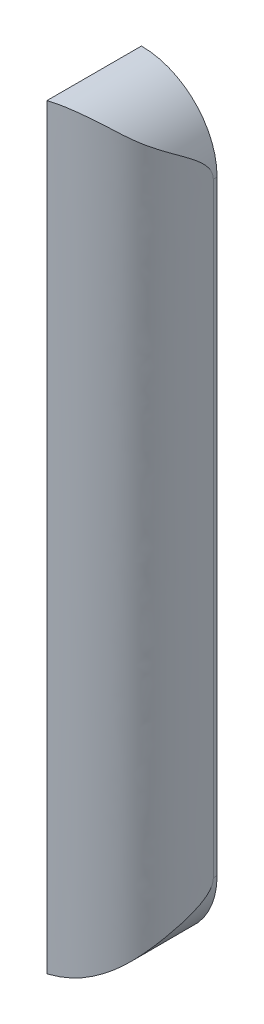
ISO-10303-21;
HEADER;
FILE_DESCRIPTION(('STEP AP214'),'2;1');
FILE_NAME('part.step','',(''),(''),'','','');
FILE_SCHEMA(('AUTOMOTIVE_DESIGN { 1 0 10303 214 1 1 1 1 }'));
ENDSEC;
DATA;
#1=APPLICATION_CONTEXT('core data for automotive mechanical design processes');
#2=APPLICATION_PROTOCOL_DEFINITION('international standard','automotive_design',2000,#1);
#3=PRODUCT_CONTEXT('',#1,'mechanical');
#4=PRODUCT('Part','Part','',(#3));
#5=PRODUCT_RELATED_PRODUCT_CATEGORY('part','',(#4));
#6=PRODUCT_DEFINITION_FORMATION('','',#4);
#7=PRODUCT_DEFINITION_CONTEXT('part definition',#1,'design');
#8=PRODUCT_DEFINITION('design','',#6,#7);
#9=PRODUCT_DEFINITION_SHAPE('','',#8);
#10=(LENGTH_UNIT() NAMED_UNIT(*) SI_UNIT(.MILLI.,.METRE.));
#11=(NAMED_UNIT(*) PLANE_ANGLE_UNIT() SI_UNIT($,.RADIAN.));
#12=(NAMED_UNIT(*) SI_UNIT($,.STERADIAN.) SOLID_ANGLE_UNIT());
#13=UNCERTAINTY_MEASURE_WITH_UNIT(LENGTH_MEASURE(1.E-05),#10,'distance_accuracy_value','');
#14=(GEOMETRIC_REPRESENTATION_CONTEXT(3) GLOBAL_UNCERTAINTY_ASSIGNED_CONTEXT((#13)) GLOBAL_UNIT_ASSIGNED_CONTEXT((#10,
#11,#12)) REPRESENTATION_CONTEXT('',''));
#15=CARTESIAN_POINT('',(0.,0.,0.));
#16=DIRECTION('',(0.,0.,1.));
#17=DIRECTION('',(1.,0.,0.));
#18=AXIS2_PLACEMENT_3D('',#15,#16,#17);
#19=CARTESIAN_POINT('',(-4.00000000000001,40.,0.4));
#20=DIRECTION('',(1.,0.,0.));
#21=DIRECTION('',(0.,1.,0.));
#22=AXIS2_PLACEMENT_3D('',#19,#20,#21);
#23=PLANE('',#22);
#24=DIRECTION('',(0.,-1.,0.));
#25=VECTOR('',#24,1.);
#26=CARTESIAN_POINT('',(-4.00000000000001,40.,0.));
#27=LINE('',#26,#25);
#28=CARTESIAN_POINT('',(-4.00000000000001,40.,0.));
#29=VERTEX_POINT('',#28);
#30=CARTESIAN_POINT('',(-4.,-40.,0.));
#31=VERTEX_POINT('',#30);
#32=EDGE_CURVE('E127',#29,#31,#27,.T.);
#33=ORIENTED_EDGE('',*,*,#32,.T.);
#34=DIRECTION('',(0.,0.,-1.));
#35=VECTOR('',#34,1.);
#36=CARTESIAN_POINT('',(-4.,-40.,0.4));
#37=LINE('',#36,#35);
#38=CARTESIAN_POINT('',(-4.,-40.,10.));
#39=VERTEX_POINT('',#38);
#40=EDGE_CURVE('E137',#39,#31,#37,.T.);
#41=ORIENTED_EDGE('',*,*,#40,.F.);
#42=DIRECTION('',(0.,-1.,0.));
#43=VECTOR('',#42,1.);
#44=CARTESIAN_POINT('',(-4.,52.8062484748657,10.));
#45=LINE('',#44,#43);
#46=CARTESIAN_POINT('',(-4.,40.,10.));
#47=VERTEX_POINT('',#46);
#48=EDGE_CURVE('E123',#47,#39,#45,.T.);
#49=ORIENTED_EDGE('',*,*,#48,.F.);
#50=DIRECTION('',(0.,0.,-1.));
#51=VECTOR('',#50,1.);
#52=CARTESIAN_POINT('',(-4.00000000000001,40.,0.4));
#53=LINE('',#52,#51);
#54=EDGE_CURVE('E130',#47,#29,#53,.T.);
#55=ORIENTED_EDGE('',*,*,#54,.T.);
#56=EDGE_LOOP('',(#33,#41,#49,#55));
#57=FACE_BOUND('',#56,.T.);
#58=DIRECTION('',(0.,-1.,0.));
#59=VECTOR('',#58,1.);
#60=CARTESIAN_POINT('',(-4.00000000000001,40.,1.));
#61=LINE('',#60,#59);
#62=CARTESIAN_POINT('',(-4.00000000000001,39.,1.));
#63=VERTEX_POINT('',#62);
#64=CARTESIAN_POINT('',(-4.,-39.,1.));
#65=VERTEX_POINT('',#64);
#66=EDGE_CURVE('E108',#63,#65,#61,.T.);
#67=ORIENTED_EDGE('',*,*,#66,.F.);
#68=DIRECTION('',(0.,0.,-1.));
#69=VECTOR('',#68,1.);
#70=CARTESIAN_POINT('',(-4.00000000000001,39.,8.94346104894894));
#71=LINE('',#70,#69);
#72=CARTESIAN_POINT('',(-4.00000000000001,39.,8.94346104894894));
#73=VERTEX_POINT('',#72);
#74=EDGE_CURVE('E114',#73,#63,#71,.T.);
#75=ORIENTED_EDGE('',*,*,#74,.F.);
#76=DIRECTION('',(0.,-1.,0.));
#77=VECTOR('',#76,1.);
#78=CARTESIAN_POINT('',(-4.00000000000001,39.,8.94346104894894));
#79=LINE('',#78,#77);
#80=CARTESIAN_POINT('',(-4.,-39.,8.94346104894894));
#81=VERTEX_POINT('',#80);
#82=EDGE_CURVE('E51',#73,#81,#79,.T.);
#83=ORIENTED_EDGE('',*,*,#82,.T.);
#84=DIRECTION('',(0.,0.,-1.));
#85=VECTOR('',#84,1.);
#86=CARTESIAN_POINT('',(-4.,-39.,8.94346104894894));
#87=LINE('',#86,#85);
#88=EDGE_CURVE('E102',#81,#65,#87,.T.);
#89=ORIENTED_EDGE('',*,*,#88,.T.);
#90=EDGE_LOOP('',(#67,#75,#83,#89));
#91=FACE_BOUND('',#90,.T.);
#92=ADVANCED_FACE('F31',(#57,#91),#23,.F.);
#93=CARTESIAN_POINT('',(3.99999999999998,40.,0.4));
#94=DIRECTION('',(-1.,0.,0.));
#95=DIRECTION('',(0.,-1.,0.));
#96=AXIS2_PLACEMENT_3D('',#93,#94,#95);
#97=PLANE('',#96);
#98=DIRECTION('',(0.,1.,0.));
#99=VECTOR('',#98,1.);
#100=CARTESIAN_POINT('',(3.99999999999998,40.,0.));
#101=LINE('',#100,#99);
#102=CARTESIAN_POINT('',(4.,-32.,0.));
#103=VERTEX_POINT('',#102);
#104=CARTESIAN_POINT('',(3.99999999999999,32.,0.));
#105=VERTEX_POINT('',#104);
#106=EDGE_CURVE('E131',#103,#105,#101,.T.);
#107=ORIENTED_EDGE('',*,*,#106,.T.);
#108=DIRECTION('',(0.,0.,-1.));
#109=VECTOR('',#108,1.);
#110=CARTESIAN_POINT('',(3.99999999999999,32.,0.4));
#111=LINE('',#110,#109);
#112=CARTESIAN_POINT('',(3.99999999999999,32.,0.4));
#113=VERTEX_POINT('',#112);
#114=EDGE_CURVE('E59',#105,#113,#111,.F.);
#115=ORIENTED_EDGE('',*,*,#114,.T.);
#116=DIRECTION('',(0.,1.,0.));
#117=VECTOR('',#116,1.);
#118=CARTESIAN_POINT('',(3.99999999999998,40.,0.4));
#119=LINE('',#118,#117);
#120=CARTESIAN_POINT('',(4.,-32.,0.4));
#121=VERTEX_POINT('',#120);
#122=EDGE_CURVE('E128',#121,#113,#119,.T.);
#123=ORIENTED_EDGE('',*,*,#122,.F.);
#124=DIRECTION('',(0.,0.,-1.));
#125=VECTOR('',#124,1.);
#126=CARTESIAN_POINT('',(4.,-32.,0.4));
#127=LINE('',#126,#125);
#128=EDGE_CURVE('E144',#121,#103,#127,.T.);
#129=ORIENTED_EDGE('',*,*,#128,.T.);
#130=EDGE_LOOP('',(#107,#115,#123,#129));
#131=FACE_BOUND('',#130,.T.);
#132=ADVANCED_FACE('F189',(#131),#97,.F.);
#133=CARTESIAN_POINT('',(-4.,-40.,0.));
#134=DIRECTION('',(0.,0.,1.));
#135=DIRECTION('',(1.,0.,0.));
#136=AXIS2_PLACEMENT_3D('',#133,#134,#135);
#137=PLANE('',#136);
#138=ORIENTED_EDGE('',*,*,#32,.F.);
#139=CARTESIAN_POINT('',(-4.00000000000001,32.,0.));
#140=DIRECTION('',(0.,0.,1.));
#141=DIRECTION('',(1.,0.,0.));
#142=AXIS2_PLACEMENT_3D('',#139,#140,#141);
#143=CIRCLE('',#142,8.);
#144=EDGE_CURVE('E142',#29,#105,#143,.F.);
#145=ORIENTED_EDGE('',*,*,#144,.T.);
#146=ORIENTED_EDGE('',*,*,#106,.F.);
#147=CARTESIAN_POINT('',(-4.,-32.,0.));
#148=DIRECTION('',(0.,0.,1.));
#149=DIRECTION('',(1.,0.,0.));
#150=AXIS2_PLACEMENT_3D('',#147,#148,#149);
#151=CIRCLE('',#150,8.);
#152=EDGE_CURVE('E140',#103,#31,#151,.F.);
#153=ORIENTED_EDGE('',*,*,#152,.T.);
#154=EDGE_LOOP('',(#138,#145,#146,#153));
#155=FACE_BOUND('',#154,.T.);
#156=ADVANCED_FACE('F156',(#155),#137,.F.);
#157=CARTESIAN_POINT('',(4.00000000000001,52.8062484748657,0.399999999999993));
#158=CARTESIAN_POINT('',(3.45990071294035,52.8062484748657,2.8916558516028));
#159=CARTESIAN_POINT('',(2.80557940591991,52.8062484748657,5.91025549157195));
#160=CARTESIAN_POINT('',(-0.739115300552893,52.8062484748657,8.89056329612947));
#161=CARTESIAN_POINT('',(-2.54040997583752,52.8062484748657,9.5034099961634));
#162=CARTESIAN_POINT('',(-4.,52.8062484748657,10.));
#163=B_SPLINE_CURVE_WITH_KNOTS('',3,(#157,#158,#159,#160,#161,#162),.UNSPECIFIED.,.F.,.F.,(4,1,
1,4),(0.,0.472850407692934,0.572850407692934,1.),.UNSPECIFIED.);
#164=DIRECTION('',(0.,-1.,0.));
#165=VECTOR('',#164,1.);
#166=SURFACE_OF_LINEAR_EXTRUSION('',#163,#165);
#167=ORIENTED_EDGE('',*,*,#122,.T.);
#168=CARTESIAN_POINT('',(3.99999999999999,32.,0.4));
#169=CARTESIAN_POINT('',(4.0000056620052,32.0525621529477,0.399973787301287));
#170=CARTESIAN_POINT('',(3.99948219702425,32.1051096960676,0.402388770322981));
#171=CARTESIAN_POINT('',(3.99742065157941,32.2096907531144,0.411899399725262));
#172=CARTESIAN_POINT('',(3.99588393285891,32.2617248619337,0.418988764058434));
#173=CARTESIAN_POINT('',(3.99186724188595,32.3642245573067,0.437518536287896));
#174=CARTESIAN_POINT('',(3.98940059314111,32.4147018819559,0.448897485307127));
#175=CARTESIAN_POINT('',(3.98359289393308,32.5145338588227,0.475686410071853));
#176=CARTESIAN_POINT('',(3.98025151057988,32.5638880758402,0.491097920452378));
#177=CARTESIAN_POINT('',(3.97159699575429,32.676581837533,0.531006621363169));
#178=CARTESIAN_POINT('',(3.96599432499394,32.7394279739851,0.556836535063332));
#179=CARTESIAN_POINT('',(3.95361019354151,32.8625058508912,0.613895069680141));
#180=CARTESIAN_POINT('',(3.94682808672251,32.9227361355899,0.645126649724052));
#181=CARTESIAN_POINT('',(3.93223247294435,33.0407902438395,0.712265519307851));
#182=CARTESIAN_POINT('',(3.92441391411204,33.0986003277967,0.74819569834093));
#183=CARTESIAN_POINT('',(3.90793227927584,33.2115542152776,0.823807699069402));
#184=CARTESIAN_POINT('',(3.89926928922898,33.2666982893288,0.863489138901021));
#185=CARTESIAN_POINT('',(3.87581727360709,33.406824907157,0.970655458170629));
#186=CARTESIAN_POINT('',(3.8604695577568,33.4898735225795,1.04054518311864));
#187=CARTESIAN_POINT('',(3.82830654665539,33.6505570778675,1.18613125283798));
#188=CARTESIAN_POINT('',(3.81148899380341,33.7281833482045,1.26183650761004));
#189=CARTESIAN_POINT('',(3.77662275067671,33.8788614589722,1.41748475129463));
#190=CARTESIAN_POINT('',(3.75857312133244,33.9519097269199,1.49743096201793));
#191=CARTESIAN_POINT('',(3.72123780211654,34.0947498932021,1.6610186135431));
#192=CARTESIAN_POINT('',(3.70194352418905,34.164511740355,1.74468412835655));
#193=CARTESIAN_POINT('',(3.6623229638204,34.3008343037721,1.91419048434751));
#194=CARTESIAN_POINT('',(3.64199772644475,34.3673981335757,2.00002908017132));
#195=CARTESIAN_POINT('',(3.60030526291042,34.4980103366622,2.17330705623468));
#196=CARTESIAN_POINT('',(3.57893829897453,34.562059335723,2.26074603020197));
#197=CARTESIAN_POINT('',(3.5304552789583,34.7016303956711,2.4555058263359));
#198=CARTESIAN_POINT('',(3.50308419494607,34.7766897624624,2.56309378539224));
#199=CARTESIAN_POINT('',(3.4466321513467,34.9247119220356,2.7792636604964));
#200=CARTESIAN_POINT('',(3.41755106730908,34.9976745616451,2.88784564840095));
#201=CARTESIAN_POINT('',(3.35750192617088,35.1421795932973,3.10552816197305));
#202=CARTESIAN_POINT('',(3.32653276750393,35.2137211233164,3.21462895543805));
#203=CARTESIAN_POINT('',(3.2625277479941,35.3558536936406,3.43284407817841));
#204=CARTESIAN_POINT('',(3.22949183897251,35.4264447117413,3.54195840771009));
#205=CARTESIAN_POINT('',(3.12689862635997,35.637567447715,3.86893142950053));
#206=CARTESIAN_POINT('',(3.05390686371897,35.7773258574395,4.08623114127537));
#207=CARTESIAN_POINT('',(2.89759603481086,36.0556538270346,4.51431120820724));
#208=CARTESIAN_POINT('',(2.81439536657734,36.1942201763265,4.72513636902651));
#209=CARTESIAN_POINT('',(2.63490419815972,36.4727482227274,5.14001777518146));
#210=CARTESIAN_POINT('',(2.53862300740431,36.6127088624572,5.34407870729008));
#211=CARTESIAN_POINT('',(2.33061033194471,36.8942797931428,5.74278791726366));
#212=CARTESIAN_POINT('',(2.21889313422523,37.0358884490281,5.93744467697696));
#213=CARTESIAN_POINT('',(2.02036553475504,37.2696904294443,6.24765076418465));
#214=CARTESIAN_POINT('',(1.93878155158731,37.3615901391147,6.36676337041595));
#215=CARTESIAN_POINT('',(1.81035831813848,37.4994253338024,6.54097111187516));
#216=CARTESIAN_POINT('',(1.7665416225133,37.5453690576789,6.59829809515275));
#217=CARTESIAN_POINT('',(1.67681969009083,37.6371835074314,6.71135617205671));
#218=CARTESIAN_POINT('',(1.63091448328755,37.6830542343459,6.7670872885833));
#219=CARTESIAN_POINT('',(1.53696427832172,37.7746280777868,6.87681978058271));
#220=CARTESIAN_POINT('',(1.48891992265208,37.8203312402366,6.93082166716299));
#221=CARTESIAN_POINT('',(1.39062511721416,37.911484465126,7.03700069640738));
#222=CARTESIAN_POINT('',(1.34037465172189,37.956934525759,7.08917782606081));
#223=CARTESIAN_POINT('',(1.23763429831004,38.047469945897,7.1920911863011));
#224=CARTESIAN_POINT('',(1.1851374589733,38.0925535689133,7.24282199180949));
#225=CARTESIAN_POINT('',(1.07818168705945,38.1819843087341,7.34284355187832));
#226=CARTESIAN_POINT('',(1.02372273507359,38.2263314182468,7.39213429218524));
#227=CARTESIAN_POINT('',(0.912925326492705,38.3141241277927,7.48946707828617));
#228=CARTESIAN_POINT('',(0.856585898341203,38.3575692424004,7.5375084550534));
#229=CARTESIAN_POINT('',(0.742161534128726,38.4433700875375,7.63247064279101));
#230=CARTESIAN_POINT('',(0.684076602672512,38.4857258209402,7.67939145671693));
#231=CARTESIAN_POINT('',(0.566244738354594,38.5692178820285,7.77227187344215));
#232=CARTESIAN_POINT('',(0.50649726339045,38.6103538027226,7.81823115395199));
#233=CARTESIAN_POINT('',(0.385474525932925,38.6912565397663,7.90933594158969));
#234=CARTESIAN_POINT('',(0.324199258871244,38.7310233520212,7.95448144628356));
#235=CARTESIAN_POINT('',(0.200245152746142,38.8090596423984,8.04382092691052));
#236=CARTESIAN_POINT('',(0.137569215210138,38.8473318330275,8.08801655422008));
#237=CARTESIAN_POINT('',(0.0107025831820572,38.9224055174176,8.17546727469224));
#238=CARTESIAN_POINT('',(-0.0534881011174989,38.95920702107,8.21872237417975));
#239=CARTESIAN_POINT('',(-0.248272721688522,39.0672899580901,8.34694606742797));
#240=CARTESIAN_POINT('',(-0.381140753694859,39.1362886601778,8.43041753048952));
#241=CARTESIAN_POINT('',(-0.652735978756054,39.2676388119349,8.59289707564818));
#242=CARTESIAN_POINT('',(-0.7914625352011,39.3299909812606,8.67190564053115));
#243=CARTESIAN_POINT('',(-1.07428947057202,39.4473904377342,8.82510519491522));
#244=CARTESIAN_POINT('',(-1.21838238231434,39.5024474227855,8.89930251185699));
#245=CARTESIAN_POINT('',(-1.51163979651008,39.6047473454215,9.04295812396082));
#246=CARTESIAN_POINT('',(-1.66080492306986,39.6519893171898,9.1124158327573));
#247=CARTESIAN_POINT('',(-1.96348942728516,39.7380464227688,9.24679412940434));
#248=CARTESIAN_POINT('',(-2.11700729892305,39.776864431934,9.31171626023865));
#249=CARTESIAN_POINT('',(-2.36567735489167,39.8318671899365,9.41248542626524));
#250=CARTESIAN_POINT('',(-2.45969645966528,39.8509052408895,9.44960456380516));
#251=CARTESIAN_POINT('',(-2.64881302610006,39.8856535509151,9.52257294718602));
#252=CARTESIAN_POINT('',(-2.74391022794673,39.9013645945397,9.55842249074971));
#253=CARTESIAN_POINT('',(-2.93498649678357,39.9293801632255,9.62905933678257));
#254=CARTESIAN_POINT('',(-3.03096549426747,39.9416849544392,9.66384672205602));
#255=CARTESIAN_POINT('',(-3.22356423071647,39.9628217502549,9.7325864299888));
#256=CARTESIAN_POINT('',(-3.32018373521305,39.9716549612453,9.76653903888465));
#257=CARTESIAN_POINT('',(-3.51388302756396,39.9858072331562,9.8338836747545));
#258=CARTESIAN_POINT('',(-3.61096285363776,39.9911259969458,9.86727565409722));
#259=CARTESIAN_POINT('',(-3.80536158231429,39.9982242975407,9.93377935569415));
#260=CARTESIAN_POINT('',(-3.90268051388529,40.0000033819482,9.9668910415863));
#261=CARTESIAN_POINT('',(-4.,40.,10.));
#262=B_SPLINE_CURVE_WITH_KNOTS('',3,(#168,#169,#170,#171,#172,#173,#174,#175,#176,#177,#178,
#179,#180,#181,#182,#183,#184,#185,#186,#187,#188,#189,#190,#191,#192,#193,#194,#195,#196,#197,
#198,#199,#200,#201,#202,#203,#204,#205,#206,#207,#208,#209,#210,#211,#212,#213,#214,#215,#216,
#217,#218,#219,#220,#221,#222,#223,#224,#225,#226,#227,#228,#229,#230,#231,#232,#233,#234,#235,
#236,#237,#238,#239,#240,#241,#242,#243,#244,#245,#246,#247,#248,#249,#250,#251,#252,#253,#254,
#255,#256,#257,#258,#259,#260,#261),.UNSPECIFIED.,.F.,.F.,(4,2,2,2,2,2,2,2,2,2,2,2,2,2,2,2,2,2,
2,2,2,2,2,2,2,2,2,2,2,2,2,2,2,2,2,2,2,2,2,2,2,2,2,2,2,2,4),(0.,0.157605082158624,
0.31499878446165,0.470218225168206,0.625496822449932,0.829702825587646,1.03402105273842,
1.23937453822486,1.44470714198819,1.7731552991601,2.10211711423555,2.43133252055866,
2.76313131548872,3.09460024364779,3.42598616114688,3.82797021294302,4.2299835566569,
4.63223373571751,5.0344932952593,5.83970568443843,6.63633352609044,7.43239734786193,
8.2277292380783,8.74087665210632,8.99746213338689,9.25404393089612,9.51054917722622,
9.76705625208867,10.024424417309,10.2817951290536,10.5393009359609,10.7968060636092,
11.0543961627831,11.3119870322777,11.5690863489174,11.8261839360644,12.3401236167216,
12.8540075936947,13.3672014311084,13.8804586441544,14.393540390402,14.7020562940941,
15.010499364462,15.318918327356,15.6272300184108,15.935567772511,16.2439449319839),.UNSPECIFIED.);
#263=EDGE_CURVE('E11',#113,#47,#262,.T.);
#264=ORIENTED_EDGE('',*,*,#263,.T.);
#265=ORIENTED_EDGE('',*,*,#48,.T.);
#266=CARTESIAN_POINT('',(-4.,-40.,10.));
#267=CARTESIAN_POINT('',(-3.84447283803048,-40.0000219178991,9.94710256173775));
#268=CARTESIAN_POINT('',(-3.68895134287131,-39.9954655236904,9.89417682741361));
#269=CARTESIAN_POINT('',(-3.37876676374908,-39.977350458397,9.78715566847858));
#270=CARTESIAN_POINT('',(-3.22410405925413,-39.9637880845859,9.73305977161967));
#271=CARTESIAN_POINT('',(-2.91659539971233,-39.927813518292,9.62262037850314));
#272=CARTESIAN_POINT('',(-2.7637496619587,-39.9054002780763,9.56627661686168));
#273=CARTESIAN_POINT('',(-2.46102692676095,-39.8520784260535,9.45055235790945));
#274=CARTESIAN_POINT('',(-2.31114516607753,-39.821184876852,9.39117739537663));
#275=CARTESIAN_POINT('',(-2.01490379243098,-39.751293530405,9.26864395175344));
#276=CARTESIAN_POINT('',(-1.86854326362038,-39.7122978664538,9.20548646971328));
#277=CARTESIAN_POINT('',(-1.58002471948061,-39.6266873214848,9.07497553989007));
#278=CARTESIAN_POINT('',(-1.437865737371,-39.5800742096238,9.00762306863837));
#279=CARTESIAN_POINT('',(-1.15820229364525,-39.4797239059717,8.86851439302963));
#280=CARTESIAN_POINT('',(-1.02070015814107,-39.4259832179417,8.79675603682299));
#281=CARTESIAN_POINT('',(-0.750804229341034,-39.3119217352079,8.64891589520311));
#282=CARTESIAN_POINT('',(-0.618411713726137,-39.2515993089614,8.57283304004205));
#283=CARTESIAN_POINT('',(-0.359004529418871,-39.1248855666682,8.4165898154469));
#284=CARTESIAN_POINT('',(-0.231990910300238,-39.0584930740922,8.33642865687765));
#285=CARTESIAN_POINT('',(-0.0457229127340713,-38.9547635540324,8.21349675838084));
#286=CARTESIAN_POINT('',(0.0156213587121012,-38.9195197993948,8.17209731264923));
#287=CARTESIAN_POINT('',(0.13692455795081,-38.8476874365415,8.08843961079789));
#288=CARTESIAN_POINT('',(0.196883478245402,-38.8110988210498,8.04618135003231));
#289=CARTESIAN_POINT('',(0.315407360140804,-38.7366280983492,7.96087486459728));
#290=CARTESIAN_POINT('',(0.373972456510301,-38.6987461170651,7.91782671702055));
#291=CARTESIAN_POINT('',(0.489715648500922,-38.6217280930166,7.8309940396917));
#292=CARTESIAN_POINT('',(0.546893748135789,-38.5825920538819,7.78720951207116));
#293=CARTESIAN_POINT('',(0.659766889027392,-38.5031788409546,7.69876709009784));
#294=CARTESIAN_POINT('',(0.715461889248318,-38.4629016356507,7.65410917163843));
#295=CARTESIAN_POINT('',(0.825276439190265,-38.3813310058561,7.56379409291597));
#296=CARTESIAN_POINT('',(0.879395980816358,-38.340037576146,7.51813692752076));
#297=CARTESIAN_POINT('',(0.988860402726437,-38.2543075588489,7.42318146705591));
#298=CARTESIAN_POINT('',(1.04411231835133,-38.2098220307676,7.37382005841947));
#299=CARTESIAN_POINT('',(1.15264919440644,-38.1200625856558,7.273670565821));
#300=CARTESIAN_POINT('',(1.20593415388196,-38.0747886682428,7.22288248116655));
#301=CARTESIAN_POINT('',(1.31040849344844,-37.9836746387234,7.11971652250992));
#302=CARTESIAN_POINT('',(1.36159839543506,-37.9378346713741,7.06733905016856));
#303=CARTESIAN_POINT('',(1.46174119605562,-37.8458540593826,6.96074293657438));
#304=CARTESIAN_POINT('',(1.51069413489299,-37.7997134201611,6.9065243284416));
#305=CARTESIAN_POINT('',(1.60637381156809,-37.7072757722334,6.79632019332086));
#306=CARTESIAN_POINT('',(1.65310109015826,-37.6609788044668,6.74033510107496));
#307=CARTESIAN_POINT('',(1.74441635151245,-37.568295266875,6.62672067541774));
#308=CARTESIAN_POINT('',(1.78900427743246,-37.521908694703,6.5690912983815));
#309=CARTESIAN_POINT('',(1.91970181845593,-37.3826895947707,6.39385260776602));
#310=CARTESIAN_POINT('',(2.00270980987949,-37.2898320868301,6.27393378677894));
#311=CARTESIAN_POINT('',(2.1611022688758,-37.1044776892947,6.02880594537108));
#312=CARTESIAN_POINT('',(2.23648250144576,-37.011981027147,5.90359404028062));
#313=CARTESIAN_POINT('',(2.38024708683379,-36.8276396208003,5.64875789894763));
#314=CARTESIAN_POINT('',(2.44863099860537,-36.73579491804,5.51913338522087));
#315=CARTESIAN_POINT('',(2.60711748832888,-36.5135178712815,5.19973527227677));
#316=CARTESIAN_POINT('',(2.6939196873873,-36.3834697212362,5.00805852489252));
#317=CARTESIAN_POINT('',(2.85651046003813,-36.124517280451,4.61935841494876));
#318=CARTESIAN_POINT('',(2.93229731164122,-35.9956131715058,4.42233422214331));
#319=CARTESIAN_POINT('',(3.07467011256418,-35.7377472621262,4.02480843590973));
#320=CARTESIAN_POINT('',(3.14124838161882,-35.6087855024643,3.82430409490561));
#321=CARTESIAN_POINT('',(3.26663910684308,-35.3491436472443,3.42229837251792));
#322=CARTESIAN_POINT('',(3.32545933282352,-35.2184654172702,3.22079820162447));
#323=CARTESIAN_POINT('',(3.40886958179003,-35.0189084011934,2.91968651963455));
#324=CARTESIAN_POINT('',(3.43586005888077,-34.9518263104085,2.8195445674623));
#325=CARTESIAN_POINT('',(3.48836889934296,-34.8159626943129,2.62003286398485));
#326=CARTESIAN_POINT('',(3.51388733522564,-34.7471812529494,2.5206630748527));
#327=CARTESIAN_POINT('',(3.56352937475429,-34.6073967286886,2.32328941825567));
#328=CARTESIAN_POINT('',(3.58765429851539,-34.5363958499919,2.22528432707481));
#329=CARTESIAN_POINT('',(3.63459197695603,-34.3914047072401,2.03119812094587));
#330=CARTESIAN_POINT('',(3.65740494050414,-34.3174149222401,1.93511670133923));
#331=CARTESIAN_POINT('',(3.69557802652875,-34.1866276104151,1.77198910799164));
#332=CARTESIAN_POINT('',(3.71125075630309,-34.1307514763812,1.70427899789816));
#333=CARTESIAN_POINT('',(3.7418892164309,-34.0165928526653,1.57072918077983));
#334=CARTESIAN_POINT('',(3.75685486196492,-33.9583100758542,1.50488969852493));
#335=CARTESIAN_POINT('',(3.78607527793413,-33.8387048989306,1.37540119266126));
#336=CARTESIAN_POINT('',(3.80032730050014,-33.7773723282808,1.31176089094183));
#337=CARTESIAN_POINT('',(3.82796721082919,-33.6513899363172,1.18763483985136));
#338=CARTESIAN_POINT('',(3.84135511677933,-33.5867401848718,1.12714902409282));
#339=CARTESIAN_POINT('',(3.86737340535711,-33.4523139534523,1.0091065969249));
#340=CARTESIAN_POINT('',(3.87998363172415,-33.3824614919717,0.951631319147756));
#341=CARTESIAN_POINT('',(3.90392488764391,-33.2382696753337,0.842198287921142));
#342=CARTESIAN_POINT('',(3.91525552236129,-33.1639289460604,0.790242237796065));
#343=CARTESIAN_POINT('',(3.93620888599981,-33.0111748816826,0.693999771580711));
#344=CARTESIAN_POINT('',(3.9458470244223,-32.9328077084496,0.649644256348727));
#345=CARTESIAN_POINT('',(3.96313527010143,-32.7713878222943,0.570019416862304));
#346=CARTESIAN_POINT('',(3.9707877894105,-32.688340944854,0.534739068904408));
#347=CARTESIAN_POINT('',(3.98084849188504,-32.5553145907154,0.488344470786225));
#348=CARTESIAN_POINT('',(3.98408804030828,-32.5067170428942,0.473402542552679));
#349=CARTESIAN_POINT('',(3.98971778788394,-32.4084481686279,0.447434284635134));
#350=CARTESIAN_POINT('',(3.99210835105096,-32.3587773120941,0.436406276802979));
#351=CARTESIAN_POINT('',(3.99600516888184,-32.2578477747146,0.418429454300401));
#352=CARTESIAN_POINT('',(3.99749678954204,-32.2065764050694,0.411548144439228));
#353=CARTESIAN_POINT('',(3.99949751671409,-32.103541686946,0.402318102136978));
#354=CARTESIAN_POINT('',(4.00000531289511,-32.0517777744879,0.39997541457182));
#355=CARTESIAN_POINT('',(4.00000000000001,-32.,0.399999999999993));
#356=B_SPLINE_CURVE_WITH_KNOTS('',3,(#266,#267,#268,#269,#270,#271,#272,#273,#274,#275,#276,
#277,#278,#279,#280,#281,#282,#283,#284,#285,#286,#287,#288,#289,#290,#291,#292,#293,#294,#295,
#296,#297,#298,#299,#300,#301,#302,#303,#304,#305,#306,#307,#308,#309,#310,#311,#312,#313,#314,
#315,#316,#317,#318,#319,#320,#321,#322,#323,#324,#325,#326,#327,#328,#329,#330,#331,#332,#333,
#334,#335,#336,#337,#338,#339,#340,#341,#342,#343,#344,#345,#346,#347,#348,#349,#350,#351,#352,
#353,#354,#355),.UNSPECIFIED.,.F.,.F.,(4,2,2,2,2,2,2,2,2,2,2,2,2,2,2,2,2,2,2,2,2,2,2,2,2,2,2,2,
2,2,2,2,2,2,2,2,2,2,2,2,2,2,2,2,4),(0.,0.492773860309059,0.985750445648557,1.47878540524413,
1.97095024712629,2.46298566540591,2.95490697014106,3.44707047215043,3.93935625462407,
4.43173765739046,4.67762692765701,4.92351752844006,5.16938425669399,5.41525027336493,
5.66112308583773,5.90699716141702,6.16621847890612,6.42543992221124,6.68459639337343,
6.94374820505726,7.20283672793699,7.46193213116038,7.98031520271793,8.49898452417924,
9.01768652231818,9.75936351928248,10.5011563355065,11.2435641483529,11.9852226880761,
12.3557629567057,12.7262849572907,13.0964499919059,13.4665559309008,13.7340417389197,
14.0015595525895,14.2700387191426,14.5385122331559,14.8122824741281,15.0861369611272,
15.3573518143162,15.6282356473529,15.7809285734849,15.9335559510684,16.0886051989386,
16.2438608113856),.UNSPECIFIED.);
#357=EDGE_CURVE('E44',#39,#121,#356,.T.);
#358=ORIENTED_EDGE('',*,*,#357,.T.);
#359=EDGE_LOOP('',(#167,#264,#265,#358));
#360=FACE_BOUND('',#359,.T.);
#361=ADVANCED_FACE('F150',(#360),#166,.T.);
#362=CARTESIAN_POINT('',(-4.00000000000001,32.,0.4));
#363=DIRECTION('',(0.,0.,-1.));
#364=DIRECTION('',(-1.,0.,0.));
#365=AXIS2_PLACEMENT_3D('',#362,#363,#364);
#366=CYLINDRICAL_SURFACE('',#365,8.);
#367=ORIENTED_EDGE('',*,*,#263,.F.);
#368=ORIENTED_EDGE('',*,*,#114,.F.);
#369=ORIENTED_EDGE('',*,*,#144,.F.);
#370=ORIENTED_EDGE('',*,*,#54,.F.);
#371=EDGE_LOOP('',(#367,#368,#369,#370));
#372=FACE_BOUND('',#371,.T.);
#373=ADVANCED_FACE('F155',(#372),#366,.T.);
#374=CARTESIAN_POINT('',(-4.,-32.,0.4));
#375=DIRECTION('',(0.,0.,-1.));
#376=DIRECTION('',(-1.,0.,0.));
#377=AXIS2_PLACEMENT_3D('',#374,#375,#376);
#378=CYLINDRICAL_SURFACE('',#377,8.);
#379=ORIENTED_EDGE('',*,*,#357,.F.);
#380=ORIENTED_EDGE('',*,*,#40,.T.);
#381=ORIENTED_EDGE('',*,*,#152,.F.);
#382=ORIENTED_EDGE('',*,*,#128,.F.);
#383=EDGE_LOOP('',(#379,#380,#381,#382));
#384=FACE_BOUND('',#383,.T.);
#385=ADVANCED_FACE('F33',(#384),#378,.T.);
#386=CARTESIAN_POINT('',(-4.,-40.,1.));
#387=DIRECTION('',(0.,0.,1.));
#388=DIRECTION('',(1.,0.,0.));
#389=AXIS2_PLACEMENT_3D('',#386,#387,#388);
#390=PLANE('',#389);
#391=CARTESIAN_POINT('',(-4.00000000000001,32.,1.));
#392=DIRECTION('',(0.,0.,1.));
#393=DIRECTION('',(1.,0.,0.));
#394=AXIS2_PLACEMENT_3D('',#391,#392,#393);
#395=CIRCLE('',#394,7.);
#396=CARTESIAN_POINT('',(2.84524928253041,33.4637493842925,0.999999999999987));
#397=VERTEX_POINT('',#396);
#398=EDGE_CURVE('E105',#63,#397,#395,.F.);
#399=ORIENTED_EDGE('',*,*,#398,.F.);
#400=ORIENTED_EDGE('',*,*,#66,.T.);
#401=CARTESIAN_POINT('',(-4.,-32.,1.));
#402=DIRECTION('',(0.,0.,1.));
#403=DIRECTION('',(1.,0.,0.));
#404=AXIS2_PLACEMENT_3D('',#401,#402,#403);
#405=CIRCLE('',#404,7.);
#406=CARTESIAN_POINT('',(2.84524928253106,-33.4637493842896,0.999999999998524));
#407=VERTEX_POINT('',#406);
#408=EDGE_CURVE('E98',#407,#65,#405,.F.);
#409=ORIENTED_EDGE('',*,*,#408,.F.);
#410=DIRECTION('',(0.,-1.,0.));
#411=VECTOR('',#410,1.);
#412=CARTESIAN_POINT('',(2.8452492825304,-33.4637493842896,1.));
#413=LINE('',#412,#411);
#414=EDGE_CURVE('E121',#397,#407,#413,.T.);
#415=ORIENTED_EDGE('',*,*,#414,.F.);
#416=EDGE_LOOP('',(#399,#400,#409,#415));
#417=FACE_BOUND('',#416,.T.);
#418=ADVANCED_FACE('F109',(#417),#390,.T.);
#419=CARTESIAN_POINT('',(4.00000000000001,52.8062484748657,0.399999999999993));
#420=CARTESIAN_POINT('',(3.45990071294035,52.8062484748657,2.8916558516028));
#421=CARTESIAN_POINT('',(2.80557940591991,52.8062484748657,5.91025549157195));
#422=CARTESIAN_POINT('',(-0.739115300552893,52.8062484748657,8.89056329612947));
#423=CARTESIAN_POINT('',(-2.54040997583752,52.8062484748657,9.5034099961634));
#424=CARTESIAN_POINT('',(-4.,52.8062484748657,10.));
#425=B_SPLINE_CURVE_WITH_KNOTS('',3,(#419,#420,#421,#422,#423,#424),.UNSPECIFIED.,.F.,.F.,(4,1,
1,4),(0.,0.472850407692934,0.572850407692934,1.),.UNSPECIFIED.);
#426=DIRECTION('',(0.,-1.,0.));
#427=VECTOR('',#426,1.);
#428=SURFACE_OF_LINEAR_EXTRUSION('',#425,#427);
#429=OFFSET_SURFACE('',#428,-1.,.F.);
#430=ORIENTED_EDGE('',*,*,#414,.T.);
#431=CARTESIAN_POINT('',(-4.,-39.,8.94346104894894));
#432=CARTESIAN_POINT('',(-3.86371780232184,-39.000016671804,8.8967887999233));
#433=CARTESIAN_POINT('',(-3.72755915749709,-38.9960208040379,8.84974355275575));
#434=CARTESIAN_POINT('',(-3.45618661378793,-38.9801635464553,8.75415095882717));
#435=CARTESIAN_POINT('',(-3.32097300234653,-38.9682998604947,8.70560317751074));
#436=CARTESIAN_POINT('',(-3.05225706640689,-38.9368653522539,8.60627153250525));
#437=CARTESIAN_POINT('',(-2.91875488990445,-38.9172938680247,8.55548747709682));
#438=CARTESIAN_POINT('',(-2.65426519759234,-38.8707360317003,8.45109364334208));
#439=CARTESIAN_POINT('',(-2.52327619295358,-38.8437542243891,8.39748561318612));
#440=CARTESIAN_POINT('',(-2.26441213713809,-38.782729318153,8.2869525056298));
#441=CARTESIAN_POINT('',(-2.13653642596039,-38.7486877306866,8.23002814011066));
#442=CARTESIAN_POINT('',(-1.8844705765431,-38.6739653128096,8.11257626632145));
#443=CARTESIAN_POINT('',(-1.76027960496212,-38.6332859973256,8.05204958220517));
#444=CARTESIAN_POINT('',(-1.51606682140697,-38.5457540632276,7.92731098139953));
#445=CARTESIAN_POINT('',(-1.39604327503463,-38.4989040526073,7.86310062801816));
#446=CARTESIAN_POINT('',(-1.16042530549636,-38.3994666075688,7.73104181065516));
#447=CARTESIAN_POINT('',(-1.04483187402322,-38.3468778985476,7.66319254015454));
#448=CARTESIAN_POINT('',(-0.818285967476497,-38.2363918424249,7.52408021449086));
#449=CARTESIAN_POINT('',(-0.707334578777134,-38.1784932626658,7.45281636849568));
#450=CARTESIAN_POINT('',(-0.544619080960086,-38.0880360850577,7.34372325674025));
#451=CARTESIAN_POINT('',(-0.491053328990142,-38.0573161873701,7.30703222436841));
#452=CARTESIAN_POINT('',(-0.38511364695409,-37.9946962191068,7.23293919781992));
#453=CARTESIAN_POINT('',(-0.332739725934575,-37.9627961395778,7.1955371982506));
#454=CARTESIAN_POINT('',(-0.229185146260266,-37.8978547023106,7.12009386211124));
#455=CARTESIAN_POINT('',(-0.178004362934318,-37.8648134647155,7.08205259305987));
#456=CARTESIAN_POINT('',(-0.0768533731893754,-37.7976378777427,7.00533153679552));
#457=CARTESIAN_POINT('',(-0.0268831570243674,-37.7635035371704,6.96665175472729));
#458=CARTESIAN_POINT('',(0.0717482168464672,-37.6942513113699,6.88851111151553));
#459=CARTESIAN_POINT('',(0.120409381205071,-37.659133431142,6.84905025434329));
#460=CARTESIAN_POINT('',(0.216335833764418,-37.58802973214,6.76922105215556));
#461=CARTESIAN_POINT('',(0.263601096542023,-37.5520438975797,6.72885269063552));
#462=CARTESIAN_POINT('',(0.359827795666352,-37.476849540759,6.64425747386933));
#463=CARTESIAN_POINT('',(0.408683243050183,-37.4375892606778,6.59995586909796));
#464=CARTESIAN_POINT('',(0.504558034897318,-37.3584345410528,6.50995429966106));
#465=CARTESIAN_POINT('',(0.551577415936071,-37.3185401141638,6.46425436288346));
#466=CARTESIAN_POINT('',(0.643602848415667,-37.2383846230553,6.37121353603302));
#467=CARTESIAN_POINT('',(0.688609537523697,-37.1981236798924,6.323873174243));
#468=CARTESIAN_POINT('',(0.776472371678329,-37.1175064261092,6.22731552994817));
#469=CARTESIAN_POINT('',(0.819328524654562,-37.0771501158413,6.17809825436525));
#470=CARTESIAN_POINT('',(0.902970408266295,-36.9964243967173,6.07797942530594));
#471=CARTESIAN_POINT('',(0.943756694376015,-36.9560549943329,6.02707832982521));
#472=CARTESIAN_POINT('',(1.02334611264628,-36.8753671630868,5.92371144816059));
#473=CARTESIAN_POINT('',(1.06214919294566,-36.8350487355851,5.87124562111546));
#474=CARTESIAN_POINT('',(1.17581298436961,-36.7141505836918,5.71157030468821));
#475=CARTESIAN_POINT('',(1.24782764832314,-36.6337257628351,5.60220452830581));
#476=CARTESIAN_POINT('',(1.38502430643406,-36.4735493135676,5.37869528948427));
#477=CARTESIAN_POINT('',(1.45020153433794,-36.3937981899215,5.26454857088145));
#478=CARTESIAN_POINT('',(1.57441488367504,-36.2350970368198,5.03241558398029));
#479=CARTESIAN_POINT('',(1.63345021132712,-36.1561471120983,4.91442882197404));
#480=CARTESIAN_POINT('',(1.77125015926784,-35.9638713256993,4.62198416769739));
#481=CARTESIAN_POINT('',(1.84703805642359,-35.8509542459112,4.44585838910843));
#482=CARTESIAN_POINT('',(1.98913593710025,-35.6260093887932,4.08932282312043));
#483=CARTESIAN_POINT('',(2.05544559511708,-35.5139816421297,3.90891288884182));
#484=CARTESIAN_POINT('',(2.18030827474083,-35.2894239206386,3.54551583585794));
#485=CARTESIAN_POINT('',(2.23885412470773,-35.176893579356,3.36252650471099));
#486=CARTESIAN_POINT('',(2.34940275011972,-34.9497522227707,2.9964234916653));
#487=CARTESIAN_POINT('',(2.4014188609574,-34.8351460136628,2.8133108571638));
#488=CARTESIAN_POINT('',(2.47542821305004,-34.659479892273,2.54008546368259));
#489=CARTESIAN_POINT('',(2.49941981007379,-34.6003235080087,2.44928800637818));
#490=CARTESIAN_POINT('',(2.54617067188616,-34.4802836385075,2.26852380796858));
#491=CARTESIAN_POINT('',(2.56893000623158,-34.4194002510499,2.17855702021337));
#492=CARTESIAN_POINT('',(2.6132662334068,-34.2954382729581,1.99999977578209));
#493=CARTESIAN_POINT('',(2.63484439875289,-34.2323621694193,1.9114079146579));
#494=CARTESIAN_POINT('',(2.67687604734839,-34.1033152594531,1.73609326982992));
#495=CARTESIAN_POINT('',(2.69732972875961,-34.0373449667611,1.64937015845481));
#496=CARTESIAN_POINT('',(2.73122091608244,-33.9217543114456,1.50379762397917));
#497=CARTESIAN_POINT('',(2.74494634193819,-33.8730601376768,1.44428116425973));
#498=CARTESIAN_POINT('',(2.77180185715166,-33.7735160815895,1.32691780450687));
#499=CARTESIAN_POINT('',(2.78493186726551,-33.7226659140622,1.26907112707496));
#500=CARTESIAN_POINT('',(2.81059007817844,-33.6182595679654,1.15529904007555));
#501=CARTESIAN_POINT('',(2.823115766601,-33.5646937223752,1.09938188748533));
#502=CARTESIAN_POINT('',(2.84742247586351,-33.4546413304625,0.990312346319474));
#503=CARTESIAN_POINT('',(2.85920351575555,-33.3981548589325,0.937159887014414));
#504=CARTESIAN_POINT('',(2.88210592772066,-33.2807285095345,0.833426773366353));
#505=CARTESIAN_POINT('',(2.8932103516524,-33.2197240738354,0.782914841092966));
#506=CARTESIAN_POINT('',(2.91430922422562,-33.0938020576636,0.686669633019159));
#507=CARTESIAN_POINT('',(2.92430333319764,-33.0288832890303,0.640937819812731));
#508=CARTESIAN_POINT('',(2.94280779065546,-32.8954944021387,0.556110029705712));
#509=CARTESIAN_POINT('',(2.95133152055254,-32.8270645767261,0.516954303282481));
#510=CARTESIAN_POINT('',(2.96665363765361,-32.6861073169609,0.446497257117503));
#511=CARTESIAN_POINT('',(2.97345422395119,-32.6135852512521,0.415185926857476));
#512=CARTESIAN_POINT('',(2.98250337388574,-32.4964791416053,0.373501992623173));
#513=CARTESIAN_POINT('',(2.98545917747057,-32.4530936034828,0.359881482333208));
#514=CARTESIAN_POINT('',(2.99059847148924,-32.3653271891512,0.336195027886819));
#515=CARTESIAN_POINT('',(2.99278230869635,-32.3209467694026,0.326127487711973));
#516=CARTESIAN_POINT('',(2.99634451360753,-32.2307153585846,0.30970427875639));
#517=CARTESIAN_POINT('',(2.99770913118395,-32.1848521876277,0.303411976124086));
#518=CARTESIAN_POINT('',(2.99954005152826,-32.09266425515,0.294969100518166));
#519=CARTESIAN_POINT('',(3.00000506322817,-32.0463389259906,0.292824480085595));
#520=CARTESIAN_POINT('',(3.,-32.,0.292848097484719));
#521=B_SPLINE_CURVE_WITH_KNOTS('',3,(#431,#432,#433,#434,#435,#436,#437,#438,#439,#440,#441,
#442,#443,#444,#445,#446,#447,#448,#449,#450,#451,#452,#453,#454,#455,#456,#457,#458,#459,#460,
#461,#462,#463,#464,#465,#466,#467,#468,#469,#470,#471,#472,#473,#474,#475,#476,#477,#478,#479,
#480,#481,#482,#483,#484,#485,#486,#487,#488,#489,#490,#491,#492,#493,#494,#495,#496,#497,#498,
#499,#500,#501,#502,#503,#504,#505,#506,#507,#508,#509,#510,#511,#512,#513,#514,#515,#516,#517,
#518,#519,#520),.UNSPECIFIED.,.F.,.F.,(4,2,2,2,2,2,2,2,2,2,2,2,2,2,2,2,2,2,2,2,2,2,2,2,2,2,2,2,
2,2,2,2,2,2,2,2,2,2,2,2,2,2,2,2,4),(0.,0.432108231474014,0.86434262494624,1.29661414698843,
1.72862114474853,2.16053574758513,2.59235191220599,3.02398615540368,3.45571646331167,
3.88754724997733,4.10301191907243,4.31847822310719,4.53392191119396,4.7493638642137,
4.96480472212153,5.18024950137246,5.41047010411232,5.64068611838945,5.87082867056805,
6.10097037408404,6.33104998605876,6.56113561157929,7.02186269410453,7.48290883642083,
7.94401449065892,8.611233356019,9.27847512967625,9.94632902196385,10.612795994856,
10.9457554634371,11.2786961180144,11.6112707232731,11.9437865315736,12.1780872538892,
12.412419068314,12.6476533239505,12.8828815586025,13.122613382722,13.3624183452303,
13.599910341767,13.8370977044254,13.9736717051808,14.1101842776387,14.2489283499836,
14.3878713933856),.UNSPECIFIED.);
#522=EDGE_CURVE('E103',#81,#407,#521,.T.);
#523=ORIENTED_EDGE('',*,*,#522,.F.);
#524=ORIENTED_EDGE('',*,*,#82,.F.);
#525=CARTESIAN_POINT('',(2.99999999999999,32.,0.292848097484797));
#526=CARTESIAN_POINT('',(3.00000485472284,32.0460131209151,0.292825474292893));
#527=CARTESIAN_POINT('',(2.99954646582933,32.0920124268714,0.294939534366094));
#528=CARTESIAN_POINT('',(2.99774111103565,32.1835606909061,0.303264499344784));
#529=CARTESIAN_POINT('',(2.9963953459996,32.2291101732852,0.309469867583241));
#530=CARTESIAN_POINT('',(2.99287759107864,32.3188341270748,0.325688247986254));
#531=CARTESIAN_POINT('',(2.99071735006378,32.3630189110664,0.335647115008598));
#532=CARTESIAN_POINT('',(2.9856322906874,32.4504002440525,0.359083628627879));
#533=CARTESIAN_POINT('',(2.9827071785095,32.4935964063297,0.372562627440075));
#534=CARTESIAN_POINT('',(2.97081283081422,32.6483810471984,0.427354694180938));
#535=CARTESIAN_POINT('',(2.95976991659688,32.7565461080023,0.478194903841102));
#536=CARTESIAN_POINT('',(2.9405805490653,32.911649024143,0.566315875900432));
#537=CARTESIAN_POINT('',(2.93371993672755,32.9623123276253,0.597788297718949));
#538=CARTESIAN_POINT('',(2.91925280421543,33.0613344402331,0.66403869762014));
#539=CARTESIAN_POINT('',(2.9116463501758,33.109693453119,0.698816382612437));
#540=CARTESIAN_POINT('',(2.88509205052229,33.2681782203937,0.81994819495912));
#541=CARTESIAN_POINT('',(2.86472080140467,33.3733699421134,0.912434454229205));
#542=CARTESIAN_POINT('',(2.8214886227833,33.574115694642,1.10686064641124));
#543=CARTESIAN_POINT('',(2.79862299797739,33.6696508740593,1.20881835250591));
#544=CARTESIAN_POINT('',(2.75072505162937,33.8538655050769,1.41946229241033));
#545=CARTESIAN_POINT('',(2.72567904154113,33.9424938660551,1.52818960113216));
#546=CARTESIAN_POINT('',(2.67375375168672,34.1140071921783,1.74945589226515));
#547=CARTESIAN_POINT('',(2.64687602454244,34.1968969043313,1.86199160679543));
#548=CARTESIAN_POINT('',(2.59654478648517,34.343155321128,2.0678797612745));
#549=CARTESIAN_POINT('',(2.57341275259767,34.4072375345631,2.16080825833431));
#550=CARTESIAN_POINT('',(2.52585445884695,34.5333290851827,2.34773784104202));
#551=CARTESIAN_POINT('',(2.50142811936119,34.5953382944575,2.44173899239726));
#552=CARTESIAN_POINT('',(2.42603083766515,34.7791632533082,2.72478879893562));
#553=CARTESIAN_POINT('',(2.37297016185805,34.8986942273277,2.91476494004186));
#554=CARTESIAN_POINT('',(2.26009259698713,35.1350214834286,3.29461187602726));
#555=CARTESIAN_POINT('',(2.20027068530729,35.2518156536688,3.48448248589342));
#556=CARTESIAN_POINT('',(2.07297340685299,35.4837230038496,3.86007261034007));
#557=CARTESIAN_POINT('',(2.00557458014235,35.5988417048289,4.04581432145949));
#558=CARTESIAN_POINT('',(1.86094689652192,35.829863973557,4.41279366159153));
#559=CARTESIAN_POINT('',(1.78372427202604,35.9457669999537,4.59403405994318));
#560=CARTESIAN_POINT('',(1.61734945101265,36.1792264129413,4.94989551081509));
#561=CARTESIAN_POINT('',(1.52820009227556,36.2967824002999,5.12451812528946));
#562=CARTESIAN_POINT('',(1.36865740093301,36.4930561309149,5.40623225208446));
#563=CARTESIAN_POINT('',(1.30230560003285,36.5712783394669,5.51595936970923));
#564=CARTESIAN_POINT('',(1.1627633413946,36.7283093959328,5.73052010529418));
#565=CARTESIAN_POINT('',(1.08957515317094,36.8071180412242,5.83535533003495));
#566=CARTESIAN_POINT('',(0.974202803490108,36.9254780015987,5.98814827645551));
#567=CARTESIAN_POINT('',(0.934831613706936,36.9649390001893,6.03831554647868));
#568=CARTESIAN_POINT('',(0.854143711208116,37.0438552373991,6.13706574466189));
#569=CARTESIAN_POINT('',(0.812827098124216,37.0833104762098,6.18564875374211));
#570=CARTESIAN_POINT('',(0.728025934266597,37.1622799618652,6.28119858886306));
#571=CARTESIAN_POINT('',(0.68453521223805,37.2017940269818,6.32816009003162));
#572=CARTESIAN_POINT('',(0.595566811927852,37.28055811501,6.42039383602699));
#573=CARTESIAN_POINT('',(0.550089035761781,37.3198081248037,6.46566599743097));
#574=CARTESIAN_POINT('',(0.457287743193028,37.3978018498125,6.55483967947815));
#575=CARTESIAN_POINT('',(0.409962641805815,37.4365450904124,6.59873996222399));
#576=CARTESIAN_POINT('',(0.313628567717998,37.5132931006637,6.68531659314241));
#577=CARTESIAN_POINT('',(0.264619633775528,37.5512978872813,6.72799296944522));
#578=CARTESIAN_POINT('',(0.165004858374268,37.6264224045914,6.81232432683539));
#579=CARTESIAN_POINT('',(0.114398102797961,37.663541606513,6.85397869809851));
#580=CARTESIAN_POINT('',(0.0117164273029811,37.7367330675881,6.93639425477122));
#581=CARTESIAN_POINT('',(-0.0403585642570164,37.7728052754797,6.97715539642335));
#582=CARTESIAN_POINT('',(-0.13248478094258,37.8347732076333,7.04768933796421));
#583=CARTESIAN_POINT('',(-0.172235375128948,37.8609293480939,7.07762679919611));
#584=CARTESIAN_POINT('',(-0.252462432351756,37.9125491817414,7.13712403744329));
#585=CARTESIAN_POINT('',(-0.29293890379609,37.9380128668989,7.16668381007698));
#586=CARTESIAN_POINT('',(-0.415468125548909,38.0133456562897,7.25474510110712));
#587=CARTESIAN_POINT('',(-0.498621593332337,38.0621571074051,7.31262929008869));
#588=CARTESIAN_POINT('',(-0.667800289649928,38.1567712466901,7.42652192805526));
#589=CARTESIAN_POINT('',(-0.753824043742198,38.2025754448369,7.48253131136927));
#590=CARTESIAN_POINT('',(-0.928731214788122,38.2910185912749,7.59253158402236));
#591=CARTESIAN_POINT('',(-1.01761456801292,38.3336576100352,7.64652251828659));
#592=CARTESIAN_POINT('',(-1.28835107551086,38.4564851273871,7.80519504536704));
#593=CARTESIAN_POINT('',(-1.47442395505995,38.5316591215529,7.90666642354517));
#594=CARTESIAN_POINT('',(-1.85652916870015,38.6668256884043,8.10048971022841));
#595=CARTESIAN_POINT('',(-2.0525598169554,38.7268208206314,8.19284315464498));
#596=CARTESIAN_POINT('',(-2.39264323018925,38.814495108994,8.34266083072075));
#597=CARTESIAN_POINT('',(-2.53465827371282,38.8464701490631,8.40228366450973));
#598=CARTESIAN_POINT('',(-2.82179486685989,38.9016809994818,8.51794939217384));
#599=CARTESIAN_POINT('',(-2.9669159925774,38.9249179944287,8.57399277045195));
#600=CARTESIAN_POINT('',(-3.25937428252254,38.9622686828414,8.68327364611895));
#601=CARTESIAN_POINT('',(-3.40671157717359,38.9763818371949,8.73651097753258));
#602=CARTESIAN_POINT('',(-3.7026495553677,38.9952595273871,8.8411356621143));
#603=CARTESIAN_POINT('',(-3.85125032907208,39.0000233903448,8.89252288186613));
#604=CARTESIAN_POINT('',(-4.00000000000001,39.,8.94346104894894));
#605=B_SPLINE_CURVE_WITH_KNOTS('',3,(#525,#526,#527,#528,#529,#530,#531,#532,#533,#534,#535,
#536,#537,#538,#539,#540,#541,#542,#543,#544,#545,#546,#547,#548,#549,#550,#551,#552,#553,#554,
#555,#556,#557,#558,#559,#560,#561,#562,#563,#564,#565,#566,#567,#568,#569,#570,#571,#572,#573,
#574,#575,#576,#577,#578,#579,#580,#581,#582,#583,#584,#585,#586,#587,#588,#589,#590,#591,#592,
#593,#594,#595,#596,#597,#598,#599,#600,#601,#602,#603,#604),.UNSPECIFIED.,.F.,.F.,(4,2,2,2,2,2,
2,2,2,2,2,2,2,2,2,2,2,2,2,2,2,2,2,2,2,2,2,2,2,2,2,2,2,2,2,2,2,2,2,4),(0.,0.137966111424408,
0.275745898863495,0.411609856574816,0.547526081716043,0.905238831096752,1.08527096532579,
1.26528715028267,1.68880787444629,2.11314003947479,2.54036047937736,2.96722319253287,
3.31286942982923,3.65853695519009,4.35031346036184,5.04260727512661,5.72844783878779,
6.41385544135,7.0991002509442,7.54952415914653,7.9997990654205,8.22474518888687,
8.44967980460055,8.67529382920745,8.90091898036131,9.12674216430248,9.35256015376686,
9.57850976256601,9.8044704155294,9.97311549434503,10.1417625278535,10.4790526970861,
10.816172192852,11.1532841807906,11.8269774333891,12.5005570083711,12.972182547476,
13.4437441262913,13.91533356634,14.3869569460656),.UNSPECIFIED.);
#606=EDGE_CURVE('E124',#397,#73,#605,.T.);
#607=ORIENTED_EDGE('',*,*,#606,.F.);
#608=EDGE_LOOP('',(#430,#523,#524,#607));
#609=FACE_BOUND('',#608,.T.);
#610=ADVANCED_FACE('F158',(#609),#429,.F.);
#611=CARTESIAN_POINT('',(-4.00000000000001,32.,0.4));
#612=DIRECTION('',(0.,0.,-1.));
#613=DIRECTION('',(-1.,0.,0.));
#614=AXIS2_PLACEMENT_3D('',#611,#612,#613);
#615=CYLINDRICAL_SURFACE('',#614,7.);
#616=ORIENTED_EDGE('',*,*,#606,.T.);
#617=ORIENTED_EDGE('',*,*,#74,.T.);
#618=ORIENTED_EDGE('',*,*,#398,.T.);
#619=EDGE_LOOP('',(#616,#617,#618));
#620=FACE_BOUND('',#619,.T.);
#621=ADVANCED_FACE('F178',(#620),#615,.F.);
#622=CARTESIAN_POINT('',(-4.,-32.,0.4));
#623=DIRECTION('',(0.,0.,-1.));
#624=DIRECTION('',(-1.,0.,0.));
#625=AXIS2_PLACEMENT_3D('',#622,#623,#624);
#626=CYLINDRICAL_SURFACE('',#625,7.);
#627=ORIENTED_EDGE('',*,*,#408,.T.);
#628=ORIENTED_EDGE('',*,*,#88,.F.);
#629=ORIENTED_EDGE('',*,*,#522,.T.);
#630=EDGE_LOOP('',(#627,#628,#629));
#631=FACE_BOUND('',#630,.T.);
#632=ADVANCED_FACE('F100',(#631),#626,.F.);
#633=CLOSED_SHELL('',(#92,#132,#156,#361,#373,#385,#418,#610,#621,#632));
#634=MANIFOLD_SOLID_BREP('B2',#633);
#635=ADVANCED_BREP_SHAPE_REPRESENTATION('',(#18,#634),#14);
#636=SHAPE_DEFINITION_REPRESENTATION(#9,#635);
ENDSEC;
END-ISO-10303-21;
